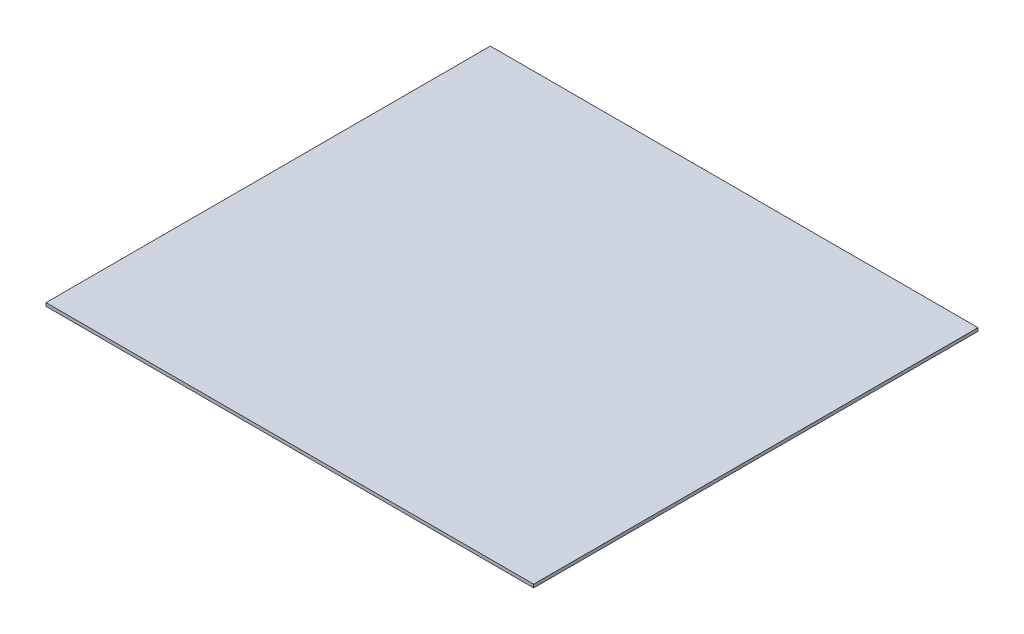
ISO-10303-21;
HEADER;
FILE_DESCRIPTION(('STEP AP214'),'2;1');
FILE_NAME('part.step','',(''),(''),'','','');
FILE_SCHEMA(('AUTOMOTIVE_DESIGN { 1 0 10303 214 1 1 1 1 }'));
ENDSEC;
DATA;
#1=APPLICATION_CONTEXT('core data for automotive mechanical design processes');
#2=APPLICATION_PROTOCOL_DEFINITION('international standard','automotive_design',2000,#1);
#3=PRODUCT_CONTEXT('',#1,'mechanical');
#4=PRODUCT('Part','Part','',(#3));
#5=PRODUCT_RELATED_PRODUCT_CATEGORY('part','',(#4));
#6=PRODUCT_DEFINITION_FORMATION('','',#4);
#7=PRODUCT_DEFINITION_CONTEXT('part definition',#1,'design');
#8=PRODUCT_DEFINITION('design','',#6,#7);
#9=PRODUCT_DEFINITION_SHAPE('','',#8);
#10=(LENGTH_UNIT() NAMED_UNIT(*) SI_UNIT(.MILLI.,.METRE.));
#11=(NAMED_UNIT(*) PLANE_ANGLE_UNIT() SI_UNIT($,.RADIAN.));
#12=(NAMED_UNIT(*) SI_UNIT($,.STERADIAN.) SOLID_ANGLE_UNIT());
#13=UNCERTAINTY_MEASURE_WITH_UNIT(LENGTH_MEASURE(1.E-05),#10,'distance_accuracy_value','');
#14=(GEOMETRIC_REPRESENTATION_CONTEXT(3) GLOBAL_UNCERTAINTY_ASSIGNED_CONTEXT((#13)) GLOBAL_UNIT_ASSIGNED_CONTEXT((#10,
#11,#12)) REPRESENTATION_CONTEXT('',''));
#15=CARTESIAN_POINT('',(0.,0.,0.));
#16=DIRECTION('',(0.,0.,1.));
#17=DIRECTION('',(1.,0.,0.));
#18=AXIS2_PLACEMENT_3D('',#15,#16,#17);
#19=CARTESIAN_POINT('',(225.,1.5,205.));
#20=DIRECTION('',(-1.,0.,0.));
#21=DIRECTION('',(0.,0.,1.));
#22=AXIS2_PLACEMENT_3D('',#19,#20,#21);
#23=PLANE('',#22);
#24=DIRECTION('',(0.,0.,-1.));
#25=VECTOR('',#24,1.);
#26=CARTESIAN_POINT('',(225.,-1.5,205.));
#27=LINE('',#26,#25);
#28=CARTESIAN_POINT('',(225.,-1.5,205.));
#29=VERTEX_POINT('',#28);
#30=CARTESIAN_POINT('',(225.,-1.5,-205.));
#31=VERTEX_POINT('',#30);
#32=EDGE_CURVE('E95',#29,#31,#27,.T.);
#33=ORIENTED_EDGE('',*,*,#32,.T.);
#34=DIRECTION('',(0.,-1.,0.));
#35=VECTOR('',#34,1.);
#36=CARTESIAN_POINT('',(225.,1.5,-205.));
#37=LINE('',#36,#35);
#38=CARTESIAN_POINT('',(225.,1.5,-205.));
#39=VERTEX_POINT('',#38);
#40=EDGE_CURVE('E11',#39,#31,#37,.T.);
#41=ORIENTED_EDGE('',*,*,#40,.F.);
#42=DIRECTION('',(0.,0.,-1.));
#43=VECTOR('',#42,1.);
#44=CARTESIAN_POINT('',(225.,1.5,205.));
#45=LINE('',#44,#43);
#46=CARTESIAN_POINT('',(225.,1.5,205.));
#47=VERTEX_POINT('',#46);
#48=EDGE_CURVE('E83',#47,#39,#45,.T.);
#49=ORIENTED_EDGE('',*,*,#48,.F.);
#50=DIRECTION('',(0.,-1.,0.));
#51=VECTOR('',#50,1.);
#52=CARTESIAN_POINT('',(225.,1.5,205.));
#53=LINE('',#52,#51);
#54=EDGE_CURVE('E91',#47,#29,#53,.T.);
#55=ORIENTED_EDGE('',*,*,#54,.T.);
#56=EDGE_LOOP('',(#33,#41,#49,#55));
#57=FACE_BOUND('',#56,.T.);
#58=ADVANCED_FACE('F32',(#57),#23,.F.);
#59=CARTESIAN_POINT('',(-225.,1.5,-205.));
#60=DIRECTION('',(0.,0.,1.));
#61=DIRECTION('',(1.,0.,0.));
#62=AXIS2_PLACEMENT_3D('',#59,#60,#61);
#63=PLANE('',#62);
#64=DIRECTION('',(-1.,0.,0.));
#65=VECTOR('',#64,1.);
#66=CARTESIAN_POINT('',(-225.,-1.5,-205.));
#67=LINE('',#66,#65);
#68=CARTESIAN_POINT('',(-225.,-1.5,-205.));
#69=VERTEX_POINT('',#68);
#70=EDGE_CURVE('E87',#31,#69,#67,.T.);
#71=ORIENTED_EDGE('',*,*,#70,.T.);
#72=DIRECTION('',(0.,-1.,0.));
#73=VECTOR('',#72,1.);
#74=CARTESIAN_POINT('',(-225.,1.5,-205.));
#75=LINE('',#74,#73);
#76=CARTESIAN_POINT('',(-225.,1.5,-205.));
#77=VERTEX_POINT('',#76);
#78=EDGE_CURVE('E40',#77,#69,#75,.T.);
#79=ORIENTED_EDGE('',*,*,#78,.F.);
#80=DIRECTION('',(-1.,0.,0.));
#81=VECTOR('',#80,1.);
#82=CARTESIAN_POINT('',(-225.,1.5,-205.));
#83=LINE('',#82,#81);
#84=EDGE_CURVE('E78',#39,#77,#83,.T.);
#85=ORIENTED_EDGE('',*,*,#84,.F.);
#86=ORIENTED_EDGE('',*,*,#40,.T.);
#87=EDGE_LOOP('',(#71,#79,#85,#86));
#88=FACE_BOUND('',#87,.T.);
#89=ADVANCED_FACE('F86',(#88),#63,.F.);
#90=CARTESIAN_POINT('',(-225.,1.5,205.));
#91=DIRECTION('',(1.,0.,0.));
#92=DIRECTION('',(0.,0.,-1.));
#93=AXIS2_PLACEMENT_3D('',#90,#91,#92);
#94=PLANE('',#93);
#95=DIRECTION('',(0.,0.,1.));
#96=VECTOR('',#95,1.);
#97=CARTESIAN_POINT('',(-225.,-1.5,205.));
#98=LINE('',#97,#96);
#99=CARTESIAN_POINT('',(-225.,-1.5,205.));
#100=VERTEX_POINT('',#99);
#101=EDGE_CURVE('E65',#69,#100,#98,.T.);
#102=ORIENTED_EDGE('',*,*,#101,.T.);
#103=DIRECTION('',(0.,-1.,0.));
#104=VECTOR('',#103,1.);
#105=CARTESIAN_POINT('',(-225.,1.5,205.));
#106=LINE('',#105,#104);
#107=CARTESIAN_POINT('',(-225.,1.5,205.));
#108=VERTEX_POINT('',#107);
#109=EDGE_CURVE('E88',#108,#100,#106,.T.);
#110=ORIENTED_EDGE('',*,*,#109,.F.);
#111=DIRECTION('',(0.,0.,1.));
#112=VECTOR('',#111,1.);
#113=CARTESIAN_POINT('',(-225.,1.5,205.));
#114=LINE('',#113,#112);
#115=EDGE_CURVE('E81',#77,#108,#114,.T.);
#116=ORIENTED_EDGE('',*,*,#115,.F.);
#117=ORIENTED_EDGE('',*,*,#78,.T.);
#118=EDGE_LOOP('',(#102,#110,#116,#117));
#119=FACE_BOUND('',#118,.T.);
#120=ADVANCED_FACE('F89',(#119),#94,.F.);
#121=CARTESIAN_POINT('',(-225.,1.5,205.));
#122=DIRECTION('',(0.,0.,-1.));
#123=DIRECTION('',(-1.,0.,0.));
#124=AXIS2_PLACEMENT_3D('',#121,#122,#123);
#125=PLANE('',#124);
#126=DIRECTION('',(1.,0.,0.));
#127=VECTOR('',#126,1.);
#128=CARTESIAN_POINT('',(-225.,-1.5,205.));
#129=LINE('',#128,#127);
#130=EDGE_CURVE('E71',#100,#29,#129,.T.);
#131=ORIENTED_EDGE('',*,*,#130,.T.);
#132=ORIENTED_EDGE('',*,*,#54,.F.);
#133=DIRECTION('',(1.,0.,0.));
#134=VECTOR('',#133,1.);
#135=CARTESIAN_POINT('',(-225.,1.5,205.));
#136=LINE('',#135,#134);
#137=EDGE_CURVE('E48',#108,#47,#136,.T.);
#138=ORIENTED_EDGE('',*,*,#137,.F.);
#139=ORIENTED_EDGE('',*,*,#109,.T.);
#140=EDGE_LOOP('',(#131,#132,#138,#139));
#141=FACE_BOUND('',#140,.T.);
#142=ADVANCED_FACE('F102',(#141),#125,.F.);
#143=CARTESIAN_POINT('',(0.,1.5,0.));
#144=DIRECTION('',(0.,-1.,0.));
#145=DIRECTION('',(0.,0.,-1.));
#146=AXIS2_PLACEMENT_3D('',#143,#144,#145);
#147=PLANE('',#146);
#148=ORIENTED_EDGE('',*,*,#48,.T.);
#149=ORIENTED_EDGE('',*,*,#84,.T.);
#150=ORIENTED_EDGE('',*,*,#115,.T.);
#151=ORIENTED_EDGE('',*,*,#137,.T.);
#152=EDGE_LOOP('',(#148,#149,#150,#151));
#153=FACE_BOUND('',#152,.T.);
#154=ADVANCED_FACE('F79',(#153),#147,.F.);
#155=CARTESIAN_POINT('',(0.,-1.5,0.));
#156=DIRECTION('',(0.,-1.,0.));
#157=DIRECTION('',(0.,0.,-1.));
#158=AXIS2_PLACEMENT_3D('',#155,#156,#157);
#159=PLANE('',#158);
#160=ORIENTED_EDGE('',*,*,#32,.F.);
#161=ORIENTED_EDGE('',*,*,#130,.F.);
#162=ORIENTED_EDGE('',*,*,#101,.F.);
#163=ORIENTED_EDGE('',*,*,#70,.F.);
#164=EDGE_LOOP('',(#160,#161,#162,#163));
#165=FACE_BOUND('',#164,.T.);
#166=ADVANCED_FACE('F105',(#165),#159,.T.);
#167=CLOSED_SHELL('',(#58,#89,#120,#142,#154,#166));
#168=MANIFOLD_SOLID_BREP('B2',#167);
#169=ADVANCED_BREP_SHAPE_REPRESENTATION('',(#18,#168),#14);
#170=SHAPE_DEFINITION_REPRESENTATION(#9,#169);
ENDSEC;
END-ISO-10303-21;
